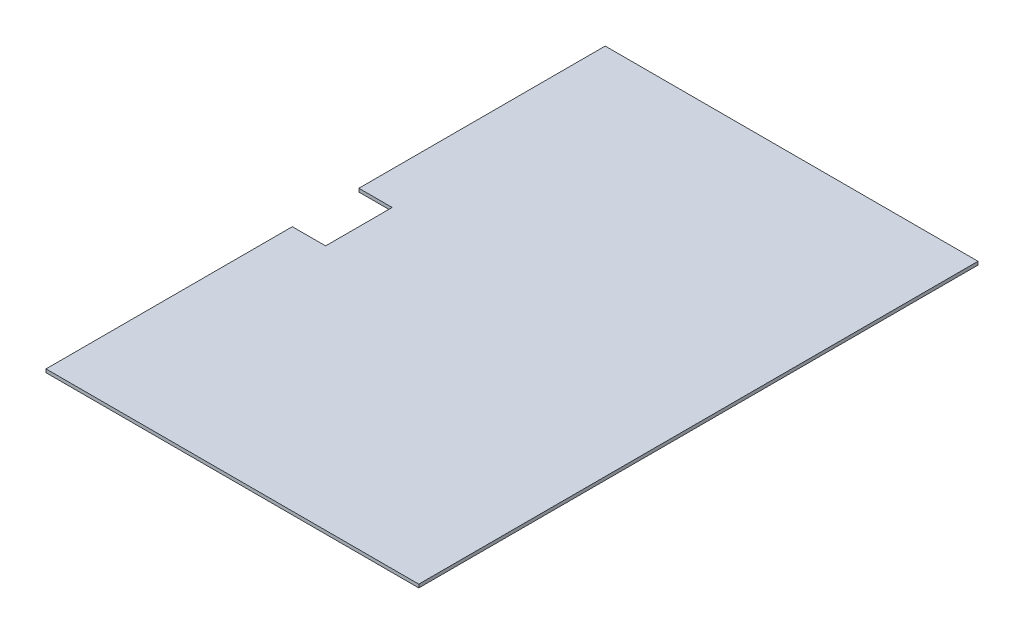
ISO-10303-21;
HEADER;
FILE_DESCRIPTION(('STEP AP214'),'2;1');
FILE_NAME('part.step','',(''),(''),'','','');
FILE_SCHEMA(('AUTOMOTIVE_DESIGN { 1 0 10303 214 1 1 1 1 }'));
ENDSEC;
DATA;
#1=APPLICATION_CONTEXT('core data for automotive mechanical design processes');
#2=APPLICATION_PROTOCOL_DEFINITION('international standard','automotive_design',2000,#1);
#3=PRODUCT_CONTEXT('',#1,'mechanical');
#4=PRODUCT('Part','Part','',(#3));
#5=PRODUCT_RELATED_PRODUCT_CATEGORY('part','',(#4));
#6=PRODUCT_DEFINITION_FORMATION('','',#4);
#7=PRODUCT_DEFINITION_CONTEXT('part definition',#1,'design');
#8=PRODUCT_DEFINITION('design','',#6,#7);
#9=PRODUCT_DEFINITION_SHAPE('','',#8);
#10=(LENGTH_UNIT() NAMED_UNIT(*) SI_UNIT(.MILLI.,.METRE.));
#11=(NAMED_UNIT(*) PLANE_ANGLE_UNIT() SI_UNIT($,.RADIAN.));
#12=(NAMED_UNIT(*) SI_UNIT($,.STERADIAN.) SOLID_ANGLE_UNIT());
#13=UNCERTAINTY_MEASURE_WITH_UNIT(LENGTH_MEASURE(1.E-05),#10,'distance_accuracy_value','');
#14=(GEOMETRIC_REPRESENTATION_CONTEXT(3) GLOBAL_UNCERTAINTY_ASSIGNED_CONTEXT((#13)) GLOBAL_UNIT_ASSIGNED_CONTEXT((#10,
#11,#12)) REPRESENTATION_CONTEXT('',''));
#15=CARTESIAN_POINT('',(0.,0.,0.));
#16=DIRECTION('',(0.,0.,1.));
#17=DIRECTION('',(1.,0.,0.));
#18=AXIS2_PLACEMENT_3D('',#15,#16,#17);
#19=CARTESIAN_POINT('',(-56.,-4.,0.));
#20=DIRECTION('',(1.,0.,0.));
#21=DIRECTION('',(0.,0.,-1.));
#22=AXIS2_PLACEMENT_3D('',#19,#20,#21);
#23=PLANE('',#22);
#24=DIRECTION('',(0.,0.,-1.));
#25=VECTOR('',#24,1.);
#26=CARTESIAN_POINT('',(-56.,-4.,0.));
#27=LINE('',#26,#25);
#28=CARTESIAN_POINT('',(-56.,-4.,-11.5));
#29=VERTEX_POINT('',#28);
#30=CARTESIAN_POINT('',(-56.,-4.,-85.5));
#31=VERTEX_POINT('',#30);
#32=EDGE_CURVE('E143',#29,#31,#27,.T.);
#33=ORIENTED_EDGE('',*,*,#32,.F.);
#34=DIRECTION('',(0.,-1.,0.));
#35=VECTOR('',#34,1.);
#36=CARTESIAN_POINT('',(-56.,-3.,-11.5));
#37=LINE('',#36,#35);
#38=CARTESIAN_POINT('',(-56.,-3.,-11.5));
#39=VERTEX_POINT('',#38);
#40=EDGE_CURVE('E137',#39,#29,#37,.T.);
#41=ORIENTED_EDGE('',*,*,#40,.F.);
#42=DIRECTION('',(0.,0.,-1.));
#43=VECTOR('',#42,1.);
#44=CARTESIAN_POINT('',(-56.,-3.,0.));
#45=LINE('',#44,#43);
#46=CARTESIAN_POINT('',(-56.,-3.,-85.5));
#47=VERTEX_POINT('',#46);
#48=EDGE_CURVE('E153',#39,#47,#45,.T.);
#49=ORIENTED_EDGE('',*,*,#48,.T.);
#50=DIRECTION('',(0.,1.,0.));
#51=VECTOR('',#50,1.);
#52=CARTESIAN_POINT('',(-56.,-4.,-85.5));
#53=LINE('',#52,#51);
#54=EDGE_CURVE('E158',#31,#47,#53,.T.);
#55=ORIENTED_EDGE('',*,*,#54,.F.);
#56=EDGE_LOOP('',(#33,#41,#49,#55));
#57=FACE_BOUND('',#56,.T.);
#58=ADVANCED_FACE('F32',(#57),#23,.F.);
#59=CARTESIAN_POINT('',(56.,-4.,0.));
#60=DIRECTION('',(-1.,0.,0.));
#61=DIRECTION('',(0.,0.,1.));
#62=AXIS2_PLACEMENT_3D('',#59,#60,#61);
#63=PLANE('',#62);
#64=DIRECTION('',(0.,0.,1.));
#65=VECTOR('',#64,1.);
#66=CARTESIAN_POINT('',(56.,-3.,0.));
#67=LINE('',#66,#65);
#68=CARTESIAN_POINT('',(56.,-3.,-85.5));
#69=VERTEX_POINT('',#68);
#70=CARTESIAN_POINT('',(56.,-3.,82.5));
#71=VERTEX_POINT('',#70);
#72=EDGE_CURVE('E136',#69,#71,#67,.T.);
#73=ORIENTED_EDGE('',*,*,#72,.T.);
#74=DIRECTION('',(0.,1.,0.));
#75=VECTOR('',#74,1.);
#76=CARTESIAN_POINT('',(56.,-4.,82.5));
#77=LINE('',#76,#75);
#78=CARTESIAN_POINT('',(56.,-4.,82.5));
#79=VERTEX_POINT('',#78);
#80=EDGE_CURVE('E11',#79,#71,#77,.T.);
#81=ORIENTED_EDGE('',*,*,#80,.F.);
#82=DIRECTION('',(0.,0.,1.));
#83=VECTOR('',#82,1.);
#84=CARTESIAN_POINT('',(56.,-4.,0.));
#85=LINE('',#84,#83);
#86=CARTESIAN_POINT('',(56.,-4.,-85.5));
#87=VERTEX_POINT('',#86);
#88=EDGE_CURVE('E140',#87,#79,#85,.T.);
#89=ORIENTED_EDGE('',*,*,#88,.F.);
#90=DIRECTION('',(0.,1.,0.));
#91=VECTOR('',#90,1.);
#92=CARTESIAN_POINT('',(56.,-4.,-85.5));
#93=LINE('',#92,#91);
#94=EDGE_CURVE('E148',#87,#69,#93,.T.);
#95=ORIENTED_EDGE('',*,*,#94,.T.);
#96=EDGE_LOOP('',(#73,#81,#89,#95));
#97=FACE_BOUND('',#96,.T.);
#98=ADVANCED_FACE('F34',(#97),#63,.F.);
#99=CARTESIAN_POINT('',(0.,-4.,82.5));
#100=DIRECTION('',(0.,0.,-1.));
#101=DIRECTION('',(-1.,0.,0.));
#102=AXIS2_PLACEMENT_3D('',#99,#100,#101);
#103=PLANE('',#102);
#104=DIRECTION('',(-1.,0.,0.));
#105=VECTOR('',#104,1.);
#106=CARTESIAN_POINT('',(0.,-3.,82.5));
#107=LINE('',#106,#105);
#108=CARTESIAN_POINT('',(-56.,-3.,82.5));
#109=VERTEX_POINT('',#108);
#110=EDGE_CURVE('E151',#71,#109,#107,.T.);
#111=ORIENTED_EDGE('',*,*,#110,.T.);
#112=DIRECTION('',(0.,1.,0.));
#113=VECTOR('',#112,1.);
#114=CARTESIAN_POINT('',(-56.,-4.,82.5));
#115=LINE('',#114,#113);
#116=CARTESIAN_POINT('',(-56.,-4.,82.5));
#117=VERTEX_POINT('',#116);
#118=EDGE_CURVE('E40',#117,#109,#115,.T.);
#119=ORIENTED_EDGE('',*,*,#118,.F.);
#120=DIRECTION('',(-1.,0.,0.));
#121=VECTOR('',#120,1.);
#122=CARTESIAN_POINT('',(0.,-4.,82.5));
#123=LINE('',#122,#121);
#124=EDGE_CURVE('E84',#79,#117,#123,.T.);
#125=ORIENTED_EDGE('',*,*,#124,.F.);
#126=ORIENTED_EDGE('',*,*,#80,.T.);
#127=EDGE_LOOP('',(#111,#119,#125,#126));
#128=FACE_BOUND('',#127,.T.);
#129=ADVANCED_FACE('F165',(#128),#103,.F.);
#130=CARTESIAN_POINT('',(-56.,-3.,8.49999999999999));
#131=VERTEX_POINT('',#130);
#132=EDGE_CURVE('E154',#109,#131,#45,.T.);
#133=ORIENTED_EDGE('',*,*,#132,.T.);
#134=DIRECTION('',(0.,-1.,0.));
#135=VECTOR('',#134,1.);
#136=CARTESIAN_POINT('',(-56.,-3.,8.49999999999999));
#137=LINE('',#136,#135);
#138=CARTESIAN_POINT('',(-56.,-4.,8.49999999999999));
#139=VERTEX_POINT('',#138);
#140=EDGE_CURVE('E47',#131,#139,#137,.T.);
#141=ORIENTED_EDGE('',*,*,#140,.T.);
#142=EDGE_CURVE('E144',#117,#139,#27,.T.);
#143=ORIENTED_EDGE('',*,*,#142,.F.);
#144=ORIENTED_EDGE('',*,*,#118,.T.);
#145=EDGE_LOOP('',(#133,#141,#143,#144));
#146=FACE_BOUND('',#145,.T.);
#147=ADVANCED_FACE('F162',(#146),#23,.F.);
#148=CARTESIAN_POINT('',(0.,-4.,-85.5));
#149=DIRECTION('',(0.,0.,1.));
#150=DIRECTION('',(1.,0.,0.));
#151=AXIS2_PLACEMENT_3D('',#148,#149,#150);
#152=PLANE('',#151);
#153=DIRECTION('',(1.,0.,0.));
#154=VECTOR('',#153,1.);
#155=CARTESIAN_POINT('',(0.,-3.,-85.5));
#156=LINE('',#155,#154);
#157=EDGE_CURVE('E77',#47,#69,#156,.T.);
#158=ORIENTED_EDGE('',*,*,#157,.T.);
#159=ORIENTED_EDGE('',*,*,#94,.F.);
#160=DIRECTION('',(1.,0.,0.));
#161=VECTOR('',#160,1.);
#162=CARTESIAN_POINT('',(0.,-4.,-85.5));
#163=LINE('',#162,#161);
#164=EDGE_CURVE('E56',#31,#87,#163,.T.);
#165=ORIENTED_EDGE('',*,*,#164,.F.);
#166=ORIENTED_EDGE('',*,*,#54,.T.);
#167=EDGE_LOOP('',(#158,#159,#165,#166));
#168=FACE_BOUND('',#167,.T.);
#169=ADVANCED_FACE('F168',(#168),#152,.F.);
#170=CARTESIAN_POINT('',(0.,-4.,0.));
#171=DIRECTION('',(0.,-1.,0.));
#172=DIRECTION('',(0.,0.,-1.));
#173=AXIS2_PLACEMENT_3D('',#170,#171,#172);
#174=PLANE('',#173);
#175=DIRECTION('',(1.,0.,0.));
#176=VECTOR('',#175,1.);
#177=CARTESIAN_POINT('',(-56.,-4.,-11.5));
#178=LINE('',#177,#176);
#179=CARTESIAN_POINT('',(-46.,-4.,-11.5));
#180=VERTEX_POINT('',#179);
#181=EDGE_CURVE('E125',#29,#180,#178,.T.);
#182=ORIENTED_EDGE('',*,*,#181,.F.);
#183=ORIENTED_EDGE('',*,*,#32,.T.);
#184=ORIENTED_EDGE('',*,*,#164,.T.);
#185=ORIENTED_EDGE('',*,*,#88,.T.);
#186=ORIENTED_EDGE('',*,*,#124,.T.);
#187=ORIENTED_EDGE('',*,*,#142,.T.);
#188=DIRECTION('',(-1.,0.,0.));
#189=VECTOR('',#188,1.);
#190=CARTESIAN_POINT('',(-56.,-4.,8.49999999999999));
#191=LINE('',#190,#189);
#192=CARTESIAN_POINT('',(-46.,-4.,8.49999999999999));
#193=VERTEX_POINT('',#192);
#194=EDGE_CURVE('E128',#193,#139,#191,.T.);
#195=ORIENTED_EDGE('',*,*,#194,.F.);
#196=DIRECTION('',(0.,0.,1.));
#197=VECTOR('',#196,1.);
#198=CARTESIAN_POINT('',(-46.,-4.,8.49999999999999));
#199=LINE('',#198,#197);
#200=EDGE_CURVE('E113',#180,#193,#199,.T.);
#201=ORIENTED_EDGE('',*,*,#200,.F.);
#202=EDGE_LOOP('',(#182,#183,#184,#185,#186,#187,#195,#201));
#203=FACE_BOUND('',#202,.T.);
#204=ADVANCED_FACE('F176',(#203),#174,.T.);
#205=CARTESIAN_POINT('',(0.,-3.,0.));
#206=DIRECTION('',(0.,-1.,0.));
#207=DIRECTION('',(0.,0.,-1.));
#208=AXIS2_PLACEMENT_3D('',#205,#206,#207);
#209=PLANE('',#208);
#210=ORIENTED_EDGE('',*,*,#48,.F.);
#211=DIRECTION('',(1.,0.,0.));
#212=VECTOR('',#211,1.);
#213=CARTESIAN_POINT('',(-56.,-3.,-11.5));
#214=LINE('',#213,#212);
#215=CARTESIAN_POINT('',(-46.,-3.,-11.5));
#216=VERTEX_POINT('',#215);
#217=EDGE_CURVE('E115',#39,#216,#214,.T.);
#218=ORIENTED_EDGE('',*,*,#217,.T.);
#219=DIRECTION('',(0.,0.,1.));
#220=VECTOR('',#219,1.);
#221=CARTESIAN_POINT('',(-46.,-3.,8.49999999999999));
#222=LINE('',#221,#220);
#223=CARTESIAN_POINT('',(-46.,-3.,8.49999999999999));
#224=VERTEX_POINT('',#223);
#225=EDGE_CURVE('E110',#216,#224,#222,.T.);
#226=ORIENTED_EDGE('',*,*,#225,.T.);
#227=DIRECTION('',(-1.,0.,0.));
#228=VECTOR('',#227,1.);
#229=CARTESIAN_POINT('',(-56.,-3.,8.49999999999999));
#230=LINE('',#229,#228);
#231=EDGE_CURVE('E117',#224,#131,#230,.T.);
#232=ORIENTED_EDGE('',*,*,#231,.T.);
#233=ORIENTED_EDGE('',*,*,#132,.F.);
#234=ORIENTED_EDGE('',*,*,#110,.F.);
#235=ORIENTED_EDGE('',*,*,#72,.F.);
#236=ORIENTED_EDGE('',*,*,#157,.F.);
#237=EDGE_LOOP('',(#210,#218,#226,#232,#233,#234,#235,#236));
#238=FACE_BOUND('',#237,.T.);
#239=ADVANCED_FACE('F124',(#238),#209,.F.);
#240=CARTESIAN_POINT('',(-46.,-3.,8.49999999999999));
#241=DIRECTION('',(1.,0.,0.));
#242=DIRECTION('',(0.,0.,-1.));
#243=AXIS2_PLACEMENT_3D('',#240,#241,#242);
#244=PLANE('',#243);
#245=ORIENTED_EDGE('',*,*,#200,.T.);
#246=DIRECTION('',(0.,-1.,0.));
#247=VECTOR('',#246,1.);
#248=CARTESIAN_POINT('',(-46.,-3.,8.49999999999999));
#249=LINE('',#248,#247);
#250=EDGE_CURVE('E107',#224,#193,#249,.T.);
#251=ORIENTED_EDGE('',*,*,#250,.F.);
#252=ORIENTED_EDGE('',*,*,#225,.F.);
#253=DIRECTION('',(0.,-1.,0.));
#254=VECTOR('',#253,1.);
#255=CARTESIAN_POINT('',(-46.,-3.,-11.5));
#256=LINE('',#255,#254);
#257=EDGE_CURVE('E134',#216,#180,#256,.T.);
#258=ORIENTED_EDGE('',*,*,#257,.T.);
#259=EDGE_LOOP('',(#245,#251,#252,#258));
#260=FACE_BOUND('',#259,.T.);
#261=ADVANCED_FACE('F108',(#260),#244,.F.);
#262=CARTESIAN_POINT('',(-56.,-3.,-11.5));
#263=DIRECTION('',(0.,0.,-1.));
#264=DIRECTION('',(-1.,0.,0.));
#265=AXIS2_PLACEMENT_3D('',#262,#263,#264);
#266=PLANE('',#265);
#267=ORIENTED_EDGE('',*,*,#181,.T.);
#268=ORIENTED_EDGE('',*,*,#257,.F.);
#269=ORIENTED_EDGE('',*,*,#217,.F.);
#270=ORIENTED_EDGE('',*,*,#40,.T.);
#271=EDGE_LOOP('',(#267,#268,#269,#270));
#272=FACE_BOUND('',#271,.T.);
#273=ADVANCED_FACE('F175',(#272),#266,.F.);
#274=CARTESIAN_POINT('',(-56.,-3.,8.49999999999999));
#275=DIRECTION('',(0.,0.,1.));
#276=DIRECTION('',(1.,0.,0.));
#277=AXIS2_PLACEMENT_3D('',#274,#275,#276);
#278=PLANE('',#277);
#279=ORIENTED_EDGE('',*,*,#194,.T.);
#280=ORIENTED_EDGE('',*,*,#140,.F.);
#281=ORIENTED_EDGE('',*,*,#231,.F.);
#282=ORIENTED_EDGE('',*,*,#250,.T.);
#283=EDGE_LOOP('',(#279,#280,#281,#282));
#284=FACE_BOUND('',#283,.T.);
#285=ADVANCED_FACE('F118',(#284),#278,.F.);
#286=CLOSED_SHELL('',(#58,#98,#129,#147,#169,#204,#239,#261,#273,#285));
#287=MANIFOLD_SOLID_BREP('B2',#286);
#288=ADVANCED_BREP_SHAPE_REPRESENTATION('',(#18,#287),#14);
#289=SHAPE_DEFINITION_REPRESENTATION(#9,#288);
ENDSEC;
END-ISO-10303-21;
